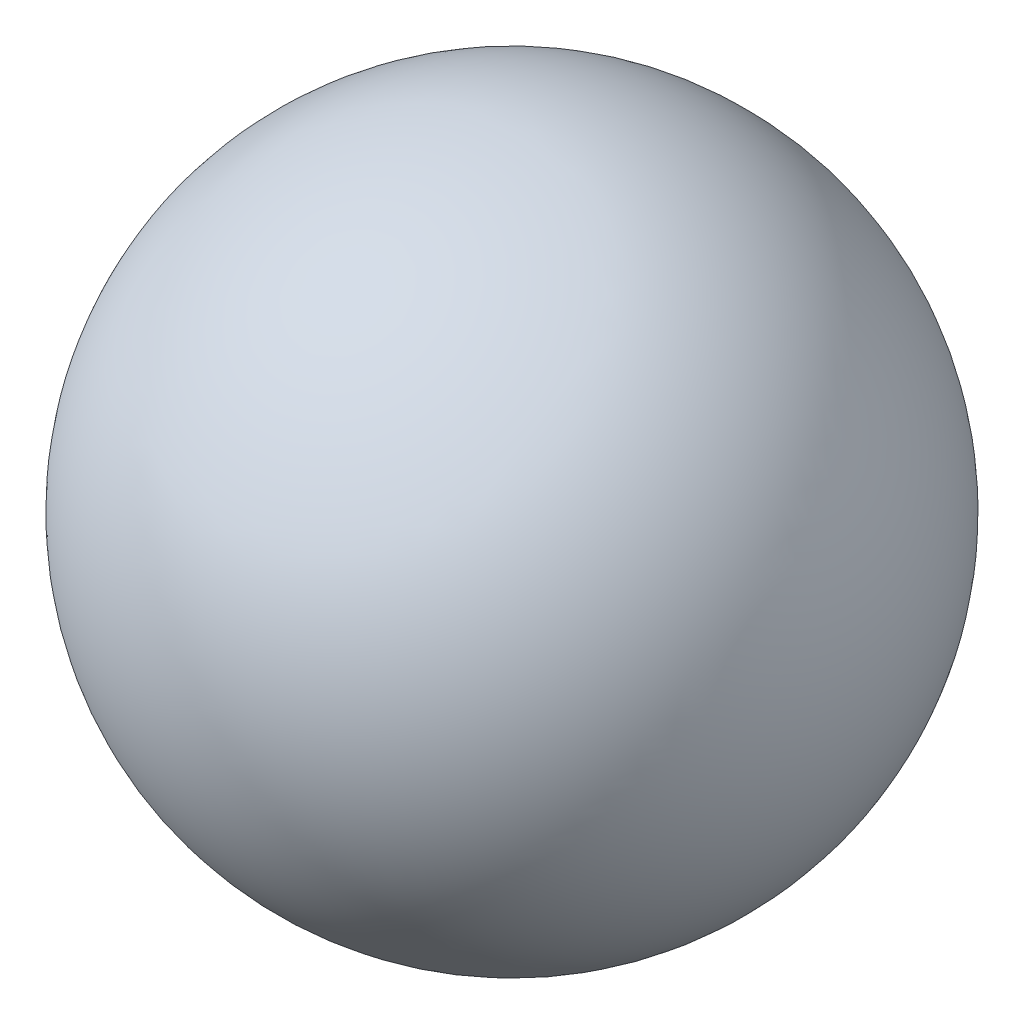
ISO-10303-21;
HEADER;
FILE_DESCRIPTION(('STEP AP214'),'2;1');
FILE_NAME('part.step','',(''),(''),'','','');
FILE_SCHEMA(('AUTOMOTIVE_DESIGN { 1 0 10303 214 1 1 1 1 }'));
ENDSEC;
DATA;
#1=APPLICATION_CONTEXT('core data for automotive mechanical design processes');
#2=APPLICATION_PROTOCOL_DEFINITION('international standard','automotive_design',2000,#1);
#3=PRODUCT_CONTEXT('',#1,'mechanical');
#4=PRODUCT('Part','Part','',(#3));
#5=PRODUCT_RELATED_PRODUCT_CATEGORY('part','',(#4));
#6=PRODUCT_DEFINITION_FORMATION('','',#4);
#7=PRODUCT_DEFINITION_CONTEXT('part definition',#1,'design');
#8=PRODUCT_DEFINITION('design','',#6,#7);
#9=PRODUCT_DEFINITION_SHAPE('','',#8);
#10=(LENGTH_UNIT() NAMED_UNIT(*) SI_UNIT(.MILLI.,.METRE.));
#11=(NAMED_UNIT(*) PLANE_ANGLE_UNIT() SI_UNIT($,.RADIAN.));
#12=(NAMED_UNIT(*) SI_UNIT($,.STERADIAN.) SOLID_ANGLE_UNIT());
#13=UNCERTAINTY_MEASURE_WITH_UNIT(LENGTH_MEASURE(1.E-05),#10,'distance_accuracy_value','');
#14=(GEOMETRIC_REPRESENTATION_CONTEXT(3) GLOBAL_UNCERTAINTY_ASSIGNED_CONTEXT((#13)) GLOBAL_UNIT_ASSIGNED_CONTEXT((#10,
#11,#12)) REPRESENTATION_CONTEXT('',''));
#15=CARTESIAN_POINT('',(0.,0.,0.));
#16=DIRECTION('',(0.,0.,1.));
#17=DIRECTION('',(1.,0.,0.));
#18=AXIS2_PLACEMENT_3D('',#15,#16,#17);
#19=CARTESIAN_POINT('',(0.,0.,0.));
#20=DIRECTION('',(-1.,0.,0.));
#21=DIRECTION('',(0.,1.,0.));
#22=AXIS2_PLACEMENT_3D('',#19,#20,#21);
#23=SPHERICAL_SURFACE('',#22,21.35);
#24=CARTESIAN_POINT('',(-21.35,0.,0.));
#25=VERTEX_POINT('',#24);
#26=VERTEX_LOOP('',#25);
#27=FACE_BOUND('',#26,.T.);
#28=ADVANCED_FACE('F33',(#27),#23,.T.);
#29=CLOSED_SHELL('',(#28));
#30=MANIFOLD_SOLID_BREP('B2',#29);
#31=ADVANCED_BREP_SHAPE_REPRESENTATION('',(#18,#30),#14);
#32=SHAPE_DEFINITION_REPRESENTATION(#9,#31);
ENDSEC;
END-ISO-10303-21;
